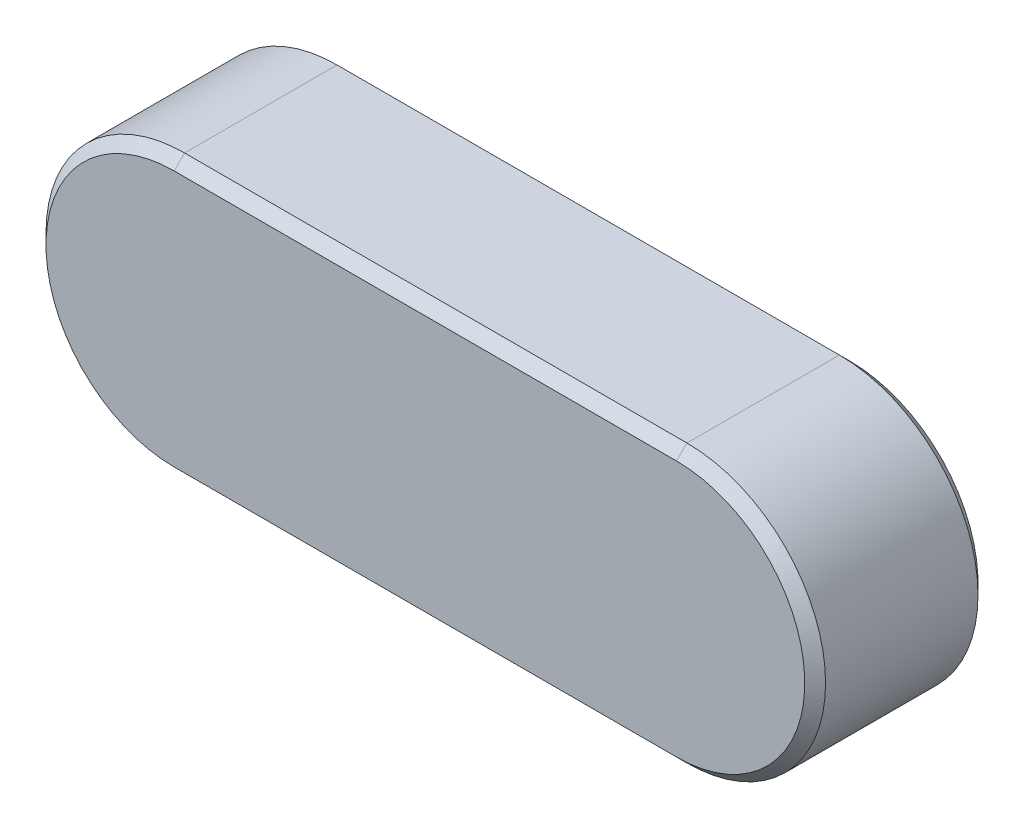
ISO-10303-21;
HEADER;
FILE_DESCRIPTION(('STEP AP214'),'2;1');
FILE_NAME('part.step','',(''),(''),'','','');
FILE_SCHEMA(('AUTOMOTIVE_DESIGN { 1 0 10303 214 1 1 1 1 }'));
ENDSEC;
DATA;
#1=APPLICATION_CONTEXT('core data for automotive mechanical design processes');
#2=APPLICATION_PROTOCOL_DEFINITION('international standard','automotive_design',2000,#1);
#3=PRODUCT_CONTEXT('',#1,'mechanical');
#4=PRODUCT('Part','Part','',(#3));
#5=PRODUCT_RELATED_PRODUCT_CATEGORY('part','',(#4));
#6=PRODUCT_DEFINITION_FORMATION('','',#4);
#7=PRODUCT_DEFINITION_CONTEXT('part definition',#1,'design');
#8=PRODUCT_DEFINITION('design','',#6,#7);
#9=PRODUCT_DEFINITION_SHAPE('','',#8);
#10=(LENGTH_UNIT() NAMED_UNIT(*) SI_UNIT(.MILLI.,.METRE.));
#11=(NAMED_UNIT(*) PLANE_ANGLE_UNIT() SI_UNIT($,.RADIAN.));
#12=(NAMED_UNIT(*) SI_UNIT($,.STERADIAN.) SOLID_ANGLE_UNIT());
#13=UNCERTAINTY_MEASURE_WITH_UNIT(LENGTH_MEASURE(1.E-05),#10,'distance_accuracy_value','');
#14=(GEOMETRIC_REPRESENTATION_CONTEXT(3) GLOBAL_UNCERTAINTY_ASSIGNED_CONTEXT((#13)) GLOBAL_UNIT_ASSIGNED_CONTEXT((#10,
#11,#12)) REPRESENTATION_CONTEXT('',''));
#15=CARTESIAN_POINT('',(0.,0.,0.));
#16=DIRECTION('',(0.,0.,1.));
#17=DIRECTION('',(1.,0.,0.));
#18=AXIS2_PLACEMENT_3D('',#15,#16,#17);
#19=CARTESIAN_POINT('',(0.,0.,5.));
#20=DIRECTION('',(0.,0.,1.));
#21=DIRECTION('',(1.,0.,0.));
#22=AXIS2_PLACEMENT_3D('',#19,#20,#21);
#23=PLANE('',#22);
#24=DIRECTION('',(1.,0.,0.));
#25=VECTOR('',#24,1.);
#26=CARTESIAN_POINT('',(0.,7.4,5.));
#27=LINE('',#26,#25);
#28=CARTESIAN_POINT('',(-14.5,7.39999993522244,4.99999987044492));
#29=VERTEX_POINT('',#28);
#30=CARTESIAN_POINT('',(14.5,7.40000006477755,4.99999993522245));
#31=VERTEX_POINT('',#30);
#32=EDGE_CURVE('E90',#29,#31,#27,.T.);
#33=ORIENTED_EDGE('',*,*,#32,.F.);
#34=CARTESIAN_POINT('',(-14.5,0.,4.99999987044492));
#35=DIRECTION('',(0.,0.,-1.));
#36=DIRECTION('',(-1.,0.,0.));
#37=AXIS2_PLACEMENT_3D('',#34,#35,#36);
#38=CIRCLE('',#37,7.39999987044489);
#39=CARTESIAN_POINT('',(-14.5,-7.39999993522246,4.99999987044492));
#40=VERTEX_POINT('',#39);
#41=EDGE_CURVE('E63',#40,#29,#38,.T.);
#42=ORIENTED_EDGE('',*,*,#41,.F.);
#43=DIRECTION('',(1.,0.,0.));
#44=VECTOR('',#43,1.);
#45=CARTESIAN_POINT('',(0.,-7.4,5.));
#46=LINE('',#45,#44);
#47=CARTESIAN_POINT('',(14.5,-7.39999993522246,4.99999987044491));
#48=VERTEX_POINT('',#47);
#49=EDGE_CURVE('E61',#48,#40,#46,.F.);
#50=ORIENTED_EDGE('',*,*,#49,.F.);
#51=CARTESIAN_POINT('',(14.5,0.,4.99999987044491));
#52=DIRECTION('',(0.,0.,-1.));
#53=DIRECTION('',(-1.,0.,0.));
#54=AXIS2_PLACEMENT_3D('',#51,#52,#53);
#55=CIRCLE('',#54,7.39999987044491);
#56=EDGE_CURVE('E20',#31,#48,#55,.T.);
#57=ORIENTED_EDGE('',*,*,#56,.F.);
#58=EDGE_LOOP('',(#33,#42,#50,#57));
#59=FACE_BOUND('',#58,.T.);
#60=ADVANCED_FACE('F17',(#59),#23,.T.);
#61=CARTESIAN_POINT('',(0.,-7.7,4.7));
#62=DIRECTION('',(0.,-0.707106781186548,0.707106781186548));
#63=DIRECTION('',(0.,-0.707106781186548,-0.707106781186548));
#64=AXIS2_PLACEMENT_3D('',#61,#62,#63);
#65=PLANE('',#64);
#66=DIRECTION('',(0.,0.707106768806912,0.707106793566183));
#67=VECTOR('',#66,1.);
#68=CARTESIAN_POINT('',(14.5,-7.38799967956001,5.01200006175));
#69=LINE('',#68,#67);
#70=CARTESIAN_POINT('',(14.5,-7.99999996498511,4.39999996498511));
#71=VERTEX_POINT('',#70);
#72=EDGE_CURVE('E68',#48,#71,#69,.F.);
#73=ORIENTED_EDGE('',*,*,#72,.F.);
#74=ORIENTED_EDGE('',*,*,#49,.T.);
#75=DIRECTION('',(0.,0.707106768806912,0.707106793566183));
#76=VECTOR('',#75,1.);
#77=CARTESIAN_POINT('',(-14.5,-7.38799967956002,5.01200006175));
#78=LINE('',#77,#76);
#79=CARTESIAN_POINT('',(-14.5,-7.99999996498511,4.39999996498511));
#80=VERTEX_POINT('',#79);
#81=EDGE_CURVE('E96',#80,#40,#78,.T.);
#82=ORIENTED_EDGE('',*,*,#81,.F.);
#83=DIRECTION('',(1.,0.,0.));
#84=VECTOR('',#83,1.);
#85=CARTESIAN_POINT('',(-22.5,-8.,4.4));
#86=LINE('',#85,#84);
#87=EDGE_CURVE('E81',#71,#80,#86,.F.);
#88=ORIENTED_EDGE('',*,*,#87,.F.);
#89=EDGE_LOOP('',(#73,#74,#82,#88));
#90=FACE_BOUND('',#89,.T.);
#91=ADVANCED_FACE('F79',(#90),#65,.T.);
#92=CARTESIAN_POINT('',(14.5,0.,4.39999985994044));
#93=DIRECTION('',(0.,0.,-1.));
#94=DIRECTION('',(-1.,0.,0.));
#95=AXIS2_PLACEMENT_3D('',#92,#93,#94);
#96=CONICAL_SURFACE('',#95,7.99999985994043,0.78539814589);
#97=DIRECTION('',(0.,-0.707106781186548,0.707106781186548));
#98=VECTOR('',#97,1.);
#99=CARTESIAN_POINT('',(14.5,7.7,4.7));
#100=LINE('',#99,#98);
#101=CARTESIAN_POINT('',(14.5,8.,4.4));
#102=VERTEX_POINT('',#101);
#103=EDGE_CURVE('E77',#31,#102,#100,.F.);
#104=ORIENTED_EDGE('',*,*,#103,.F.);
#105=ORIENTED_EDGE('',*,*,#56,.T.);
#106=ORIENTED_EDGE('',*,*,#72,.T.);
#107=CARTESIAN_POINT('',(14.5,0.,4.4));
#108=DIRECTION('',(0.,0.,-1.));
#109=DIRECTION('',(-1.,0.,0.));
#110=AXIS2_PLACEMENT_3D('',#107,#108,#109);
#111=CIRCLE('',#110,8.);
#112=EDGE_CURVE('E100',#102,#71,#111,.T.);
#113=ORIENTED_EDGE('',*,*,#112,.F.);
#114=EDGE_LOOP('',(#104,#105,#106,#113));
#115=FACE_BOUND('',#114,.T.);
#116=ADVANCED_FACE('F73',(#115),#96,.T.);
#117=CARTESIAN_POINT('',(0.,7.7,4.7));
#118=DIRECTION('',(0.,0.707106781186548,0.707106781186548));
#119=DIRECTION('',(0.,-0.707106781186548,0.707106781186548));
#120=AXIS2_PLACEMENT_3D('',#117,#118,#119);
#121=PLANE('',#120);
#122=DIRECTION('',(0.,-0.707106768806912,0.707106793566183));
#123=VECTOR('',#122,1.);
#124=CARTESIAN_POINT('',(-14.5,7.38799967955998,5.01200006175));
#125=LINE('',#124,#123);
#126=CARTESIAN_POINT('',(-14.5,7.99999996498511,4.39999996498511));
#127=VERTEX_POINT('',#126);
#128=EDGE_CURVE('E91',#29,#127,#125,.F.);
#129=ORIENTED_EDGE('',*,*,#128,.F.);
#130=ORIENTED_EDGE('',*,*,#32,.T.);
#131=ORIENTED_EDGE('',*,*,#103,.T.);
#132=DIRECTION('',(1.,0.,0.));
#133=VECTOR('',#132,1.);
#134=CARTESIAN_POINT('',(22.5,8.,4.4));
#135=LINE('',#134,#133);
#136=EDGE_CURVE('E121',#127,#102,#135,.T.);
#137=ORIENTED_EDGE('',*,*,#136,.F.);
#138=EDGE_LOOP('',(#129,#130,#131,#137));
#139=FACE_BOUND('',#138,.T.);
#140=ADVANCED_FACE('F119',(#139),#121,.T.);
#141=CARTESIAN_POINT('',(-14.5,0.,4.39999985994043));
#142=DIRECTION('',(0.,0.,-1.));
#143=DIRECTION('',(-1.,0.,0.));
#144=AXIS2_PLACEMENT_3D('',#141,#142,#143);
#145=CONICAL_SURFACE('',#144,7.99999985994045,0.78539814589);
#146=ORIENTED_EDGE('',*,*,#81,.T.);
#147=ORIENTED_EDGE('',*,*,#41,.T.);
#148=ORIENTED_EDGE('',*,*,#128,.T.);
#149=CARTESIAN_POINT('',(-14.5,0.,4.4));
#150=DIRECTION('',(0.,0.,-1.));
#151=DIRECTION('',(-1.,0.,0.));
#152=AXIS2_PLACEMENT_3D('',#149,#150,#151);
#153=CIRCLE('',#152,8.);
#154=EDGE_CURVE('E145',#80,#127,#153,.T.);
#155=ORIENTED_EDGE('',*,*,#154,.F.);
#156=EDGE_LOOP('',(#146,#147,#148,#155));
#157=FACE_BOUND('',#156,.T.);
#158=ADVANCED_FACE('F221',(#157),#145,.T.);
#159=CARTESIAN_POINT('',(-22.5,-8.,-5.));
#160=DIRECTION('',(0.,-1.,0.));
#161=DIRECTION('',(0.,0.,-1.));
#162=AXIS2_PLACEMENT_3D('',#159,#160,#161);
#163=PLANE('',#162);
#164=DIRECTION('',(0.,0.,-1.));
#165=VECTOR('',#164,1.);
#166=CARTESIAN_POINT('',(-14.5,-8.,5.015648));
#167=LINE('',#166,#165);
#168=CARTESIAN_POINT('',(-14.5,-7.99999992997022,-4.39999989495533));
#169=VERTEX_POINT('',#168);
#170=EDGE_CURVE('E142',#169,#80,#167,.F.);
#171=ORIENTED_EDGE('',*,*,#170,.F.);
#172=DIRECTION('',(1.,0.,0.));
#173=VECTOR('',#172,1.);
#174=CARTESIAN_POINT('',(0.,-8.,-4.4));
#175=LINE('',#174,#173);
#176=CARTESIAN_POINT('',(14.5,-7.99999992997022,-4.39999992997022));
#177=VERTEX_POINT('',#176);
#178=EDGE_CURVE('E162',#177,#169,#175,.F.);
#179=ORIENTED_EDGE('',*,*,#178,.F.);
#180=DIRECTION('',(0.,0.,-1.));
#181=VECTOR('',#180,1.);
#182=CARTESIAN_POINT('',(14.5,-8.,5.015648));
#183=LINE('',#182,#181);
#184=EDGE_CURVE('E113',#71,#177,#183,.T.);
#185=ORIENTED_EDGE('',*,*,#184,.F.);
#186=ORIENTED_EDGE('',*,*,#87,.T.);
#187=EDGE_LOOP('',(#171,#179,#185,#186));
#188=FACE_BOUND('',#187,.T.);
#189=ADVANCED_FACE('F223',(#188),#163,.T.);
#190=CARTESIAN_POINT('',(14.5,0.,5.015648));
#191=DIRECTION('',(0.,0.,-1.));
#192=DIRECTION('',(-1.,0.,0.));
#193=AXIS2_PLACEMENT_3D('',#190,#191,#192);
#194=CYLINDRICAL_SURFACE('',#193,8.);
#195=ORIENTED_EDGE('',*,*,#184,.T.);
#196=CARTESIAN_POINT('',(14.5,0.,-4.39999985994044));
#197=DIRECTION('',(0.,0.,1.));
#198=DIRECTION('',(-1.,7.17364886173E-13,0.));
#199=AXIS2_PLACEMENT_3D('',#196,#197,#198);
#200=CIRCLE('',#199,7.99999985994044);
#201=CARTESIAN_POINT('',(14.5,7.99999996498511,-4.39999996498511));
#202=VERTEX_POINT('',#201);
#203=EDGE_CURVE('E140',#202,#177,#200,.F.);
#204=ORIENTED_EDGE('',*,*,#203,.F.);
#205=DIRECTION('',(0.,0.,1.));
#206=VECTOR('',#205,1.);
#207=CARTESIAN_POINT('',(14.5,8.,-5.));
#208=LINE('',#207,#206);
#209=EDGE_CURVE('E130',#102,#202,#208,.F.);
#210=ORIENTED_EDGE('',*,*,#209,.F.);
#211=ORIENTED_EDGE('',*,*,#112,.T.);
#212=EDGE_LOOP('',(#195,#204,#210,#211));
#213=FACE_BOUND('',#212,.T.);
#214=ADVANCED_FACE('F138',(#213),#194,.T.);
#215=CARTESIAN_POINT('',(22.5,8.,-5.));
#216=DIRECTION('',(0.,1.,0.));
#217=DIRECTION('',(0.,0.,1.));
#218=AXIS2_PLACEMENT_3D('',#215,#216,#217);
#219=PLANE('',#218);
#220=ORIENTED_EDGE('',*,*,#209,.T.);
#221=DIRECTION('',(1.,0.,0.));
#222=VECTOR('',#221,1.);
#223=CARTESIAN_POINT('',(0.,8.,-4.4));
#224=LINE('',#223,#222);
#225=CARTESIAN_POINT('',(-14.5,7.99999992997022,-4.39999992997022));
#226=VERTEX_POINT('',#225);
#227=EDGE_CURVE('E180',#226,#202,#224,.T.);
#228=ORIENTED_EDGE('',*,*,#227,.F.);
#229=DIRECTION('',(0.,0.,-1.));
#230=VECTOR('',#229,1.);
#231=CARTESIAN_POINT('',(-14.5,8.,5.015648));
#232=LINE('',#231,#230);
#233=EDGE_CURVE('E133',#127,#226,#232,.T.);
#234=ORIENTED_EDGE('',*,*,#233,.F.);
#235=ORIENTED_EDGE('',*,*,#136,.T.);
#236=EDGE_LOOP('',(#220,#228,#234,#235));
#237=FACE_BOUND('',#236,.T.);
#238=ADVANCED_FACE('F126',(#237),#219,.T.);
#239=CARTESIAN_POINT('',(-14.5,0.,5.015648));
#240=DIRECTION('',(0.,0.,-1.));
#241=DIRECTION('',(-1.,0.,0.));
#242=AXIS2_PLACEMENT_3D('',#239,#240,#241);
#243=CYLINDRICAL_SURFACE('',#242,8.);
#244=ORIENTED_EDGE('',*,*,#233,.T.);
#245=CARTESIAN_POINT('',(-14.5,0.,-4.39999985994044));
#246=DIRECTION('',(0.,0.,1.));
#247=DIRECTION('',(1.,-7.17464466098E-13,0.));
#248=AXIS2_PLACEMENT_3D('',#245,#246,#247);
#249=CIRCLE('',#248,7.99999985994044);
#250=EDGE_CURVE('E193',#169,#226,#249,.F.);
#251=ORIENTED_EDGE('',*,*,#250,.F.);
#252=ORIENTED_EDGE('',*,*,#170,.T.);
#253=ORIENTED_EDGE('',*,*,#154,.T.);
#254=EDGE_LOOP('',(#244,#251,#252,#253));
#255=FACE_BOUND('',#254,.T.);
#256=ADVANCED_FACE('F248',(#255),#243,.T.);
#257=CARTESIAN_POINT('',(0.,-7.7,-4.7));
#258=DIRECTION('',(0.,-0.707106781186548,-0.707106781186548));
#259=DIRECTION('',(0.,0.707106781186548,-0.707106781186548));
#260=AXIS2_PLACEMENT_3D('',#257,#258,#259);
#261=PLANE('',#260);
#262=DIRECTION('',(0.,0.707106768806912,-0.707106793566183));
#263=VECTOR('',#262,1.);
#264=CARTESIAN_POINT('',(-14.5,-7.38799967956,-5.01200006175));
#265=LINE('',#264,#263);
#266=CARTESIAN_POINT('',(-14.5,-7.39999993522245,-4.99999987044491));
#267=VERTEX_POINT('',#266);
#268=EDGE_CURVE('E194',#267,#169,#265,.F.);
#269=ORIENTED_EDGE('',*,*,#268,.F.);
#270=DIRECTION('',(1.,0.,0.));
#271=VECTOR('',#270,1.);
#272=CARTESIAN_POINT('',(0.,-7.4,-5.));
#273=LINE('',#272,#271);
#274=CARTESIAN_POINT('',(14.5,-7.39999993522245,-4.99999987044491));
#275=VERTEX_POINT('',#274);
#276=EDGE_CURVE('E95',#267,#275,#273,.T.);
#277=ORIENTED_EDGE('',*,*,#276,.T.);
#278=DIRECTION('',(0.,0.707106768806912,-0.707106793566183));
#279=VECTOR('',#278,1.);
#280=CARTESIAN_POINT('',(14.5,-7.38799967956001,-5.01200006175));
#281=LINE('',#280,#279);
#282=EDGE_CURVE('E176',#177,#275,#281,.T.);
#283=ORIENTED_EDGE('',*,*,#282,.F.);
#284=ORIENTED_EDGE('',*,*,#178,.T.);
#285=EDGE_LOOP('',(#269,#277,#283,#284));
#286=FACE_BOUND('',#285,.T.);
#287=ADVANCED_FACE('F245',(#286),#261,.T.);
#288=CARTESIAN_POINT('',(14.5,0.,-4.39999985994044));
#289=DIRECTION('',(0.,0.,1.));
#290=DIRECTION('',(1.,0.,0.));
#291=AXIS2_PLACEMENT_3D('',#288,#289,#290);
#292=CONICAL_SURFACE('',#291,7.99999985994044,0.78539814589);
#293=ORIENTED_EDGE('',*,*,#282,.T.);
#294=CARTESIAN_POINT('',(14.5,0.,-4.99999987044491));
#295=DIRECTION('',(0.,0.,1.));
#296=DIRECTION('',(1.,0.,0.));
#297=AXIS2_PLACEMENT_3D('',#294,#295,#296);
#298=CIRCLE('',#297,7.3999998704449);
#299=CARTESIAN_POINT('',(14.5,7.40000006477754,-4.99999993522246));
#300=VERTEX_POINT('',#299);
#301=EDGE_CURVE('E93',#275,#300,#298,.T.);
#302=ORIENTED_EDGE('',*,*,#301,.T.);
#303=DIRECTION('',(0.,0.707106781186548,0.707106781186548));
#304=VECTOR('',#303,1.);
#305=CARTESIAN_POINT('',(14.5,7.7,-4.7));
#306=LINE('',#305,#304);
#307=EDGE_CURVE('E184',#202,#300,#306,.F.);
#308=ORIENTED_EDGE('',*,*,#307,.F.);
#309=ORIENTED_EDGE('',*,*,#203,.T.);
#310=EDGE_LOOP('',(#293,#302,#308,#309));
#311=FACE_BOUND('',#310,.T.);
#312=ADVANCED_FACE('F214',(#311),#292,.T.);
#313=CARTESIAN_POINT('',(0.,7.7,-4.7));
#314=DIRECTION('',(0.,0.707106781186548,-0.707106781186548));
#315=DIRECTION('',(0.,0.707106781186548,0.707106781186548));
#316=AXIS2_PLACEMENT_3D('',#313,#314,#315);
#317=PLANE('',#316);
#318=ORIENTED_EDGE('',*,*,#307,.T.);
#319=DIRECTION('',(1.,0.,0.));
#320=VECTOR('',#319,1.);
#321=CARTESIAN_POINT('',(0.,7.4,-5.));
#322=LINE('',#321,#320);
#323=CARTESIAN_POINT('',(-14.5,7.39999993522245,-4.99999987044491));
#324=VERTEX_POINT('',#323);
#325=EDGE_CURVE('E26',#300,#324,#322,.F.);
#326=ORIENTED_EDGE('',*,*,#325,.T.);
#327=DIRECTION('',(0.,-0.707106768806912,-0.707106793566183));
#328=VECTOR('',#327,1.);
#329=CARTESIAN_POINT('',(-14.5,7.38799967956001,-5.01200006175));
#330=LINE('',#329,#328);
#331=EDGE_CURVE('E34',#226,#324,#330,.T.);
#332=ORIENTED_EDGE('',*,*,#331,.F.);
#333=ORIENTED_EDGE('',*,*,#227,.T.);
#334=EDGE_LOOP('',(#318,#326,#332,#333));
#335=FACE_BOUND('',#334,.T.);
#336=ADVANCED_FACE('F211',(#335),#317,.T.);
#337=CARTESIAN_POINT('',(-14.5,0.,-4.39999985994044));
#338=DIRECTION('',(0.,0.,1.));
#339=DIRECTION('',(1.,0.,0.));
#340=AXIS2_PLACEMENT_3D('',#337,#338,#339);
#341=CONICAL_SURFACE('',#340,7.99999985994044,0.78539814589);
#342=ORIENTED_EDGE('',*,*,#331,.T.);
#343=CARTESIAN_POINT('',(-14.5,0.,-4.99999987044491));
#344=DIRECTION('',(0.,0.,1.));
#345=DIRECTION('',(1.,0.,0.));
#346=AXIS2_PLACEMENT_3D('',#343,#344,#345);
#347=CIRCLE('',#346,7.3999998704449);
#348=EDGE_CURVE('E11',#324,#267,#347,.T.);
#349=ORIENTED_EDGE('',*,*,#348,.T.);
#350=ORIENTED_EDGE('',*,*,#268,.T.);
#351=ORIENTED_EDGE('',*,*,#250,.T.);
#352=EDGE_LOOP('',(#342,#349,#350,#351));
#353=FACE_BOUND('',#352,.T.);
#354=ADVANCED_FACE('F234',(#353),#341,.T.);
#355=CARTESIAN_POINT('',(0.,0.,-5.));
#356=DIRECTION('',(0.,0.,1.));
#357=DIRECTION('',(1.,0.,0.));
#358=AXIS2_PLACEMENT_3D('',#355,#356,#357);
#359=PLANE('',#358);
#360=ORIENTED_EDGE('',*,*,#325,.F.);
#361=ORIENTED_EDGE('',*,*,#301,.F.);
#362=ORIENTED_EDGE('',*,*,#276,.F.);
#363=ORIENTED_EDGE('',*,*,#348,.F.);
#364=EDGE_LOOP('',(#360,#361,#362,#363));
#365=FACE_BOUND('',#364,.T.);
#366=ADVANCED_FACE('F213',(#365),#359,.F.);
#367=CLOSED_SHELL('',(#60,#91,#116,#140,#158,#189,#214,#238,#256,#287,#312,#336,#354,#366));
#368=MANIFOLD_SOLID_BREP('B1',#367);
#369=ADVANCED_BREP_SHAPE_REPRESENTATION('',(#18,#368),#14);
#370=SHAPE_DEFINITION_REPRESENTATION(#9,#369);
ENDSEC;
END-ISO-10303-21;
